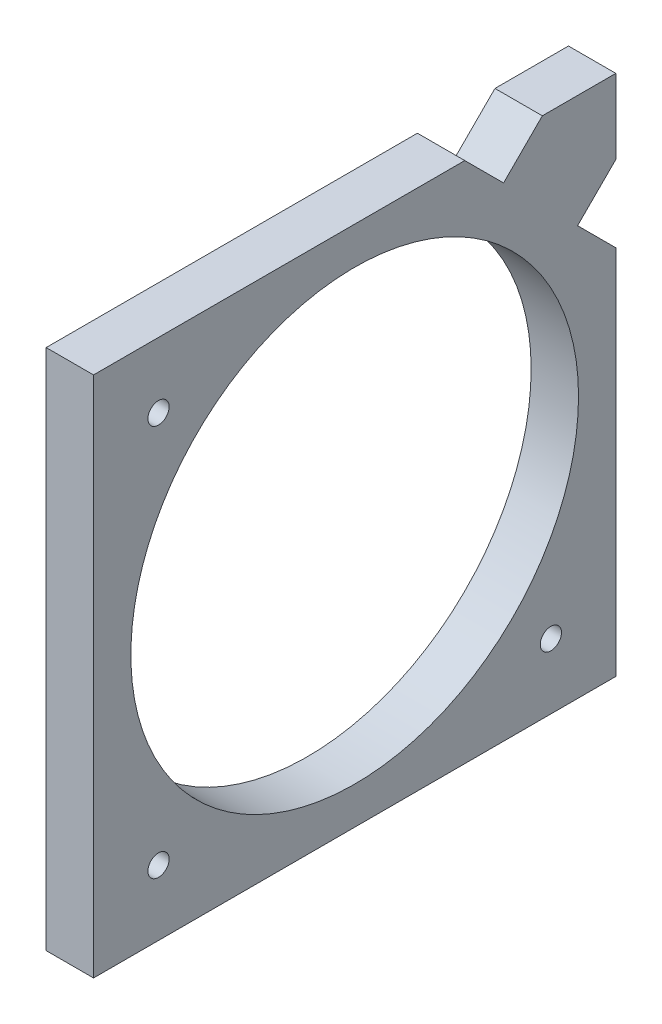
ISO-10303-21;
HEADER;
FILE_DESCRIPTION(('STEP AP214'),'2;1');
FILE_NAME('part.step','',(''),(''),'','','');
FILE_SCHEMA(('AUTOMOTIVE_DESIGN { 1 0 10303 214 1 1 1 1 }'));
ENDSEC;
DATA;
#1=APPLICATION_CONTEXT('core data for automotive mechanical design processes');
#2=APPLICATION_PROTOCOL_DEFINITION('international standard','automotive_design',2000,#1);
#3=PRODUCT_CONTEXT('',#1,'mechanical');
#4=PRODUCT('Part','Part','',(#3));
#5=PRODUCT_RELATED_PRODUCT_CATEGORY('part','',(#4));
#6=PRODUCT_DEFINITION_FORMATION('','',#4);
#7=PRODUCT_DEFINITION_CONTEXT('part definition',#1,'design');
#8=PRODUCT_DEFINITION('design','',#6,#7);
#9=PRODUCT_DEFINITION_SHAPE('','',#8);
#10=(LENGTH_UNIT() NAMED_UNIT(*) SI_UNIT(.MILLI.,.METRE.));
#11=(NAMED_UNIT(*) PLANE_ANGLE_UNIT() SI_UNIT($,.RADIAN.));
#12=(NAMED_UNIT(*) SI_UNIT($,.STERADIAN.) SOLID_ANGLE_UNIT());
#13=UNCERTAINTY_MEASURE_WITH_UNIT(LENGTH_MEASURE(1.E-05),#10,'distance_accuracy_value','');
#14=(GEOMETRIC_REPRESENTATION_CONTEXT(3) GLOBAL_UNCERTAINTY_ASSIGNED_CONTEXT((#13)) GLOBAL_UNIT_ASSIGNED_CONTEXT((#10,
#11,#12)) REPRESENTATION_CONTEXT('',''));
#15=CARTESIAN_POINT('',(0.,0.,0.));
#16=DIRECTION('',(0.,0.,1.));
#17=DIRECTION('',(1.,0.,0.));
#18=AXIS2_PLACEMENT_3D('',#15,#16,#17);
#19=CARTESIAN_POINT('',(6.35,0.,0.));
#20=DIRECTION('',(-1.,0.,0.));
#21=DIRECTION('',(0.,0.,1.));
#22=AXIS2_PLACEMENT_3D('',#19,#20,#21);
#23=PLANE('',#22);
#24=CARTESIAN_POINT('',(6.35,8.75,-61.2925582476535));
#25=DIRECTION('',(1.,0.,0.));
#26=DIRECTION('',(0.,0.,-1.));
#27=AXIS2_PLACEMENT_3D('',#24,#25,#26);
#28=CIRCLE('',#27,1.42240000000001);
#29=CARTESIAN_POINT('',(6.35,8.75,-62.7149582476535));
#30=VERTEX_POINT('',#29);
#31=EDGE_CURVE('E228',#30,#30,#28,.T.);
#32=ORIENTED_EDGE('',*,*,#31,.F.);
#33=EDGE_LOOP('',(#32));
#34=FACE_BOUND('',#33,.T.);
#35=CARTESIAN_POINT('',(6.35,8.75,-8.70744175234652));
#36=DIRECTION('',(1.,0.,0.));
#37=DIRECTION('',(0.,0.,1.));
#38=AXIS2_PLACEMENT_3D('',#35,#36,#37);
#39=CIRCLE('',#38,1.4224);
#40=CARTESIAN_POINT('',(6.35,8.75,-7.28504175234652));
#41=VERTEX_POINT('',#40);
#42=EDGE_CURVE('E222',#41,#41,#39,.T.);
#43=ORIENTED_EDGE('',*,*,#42,.F.);
#44=EDGE_LOOP('',(#43));
#45=FACE_BOUND('',#44,.T.);
#46=CARTESIAN_POINT('',(6.35,61.25,-8.70744175234652));
#47=DIRECTION('',(1.,0.,0.));
#48=DIRECTION('',(0.,0.,-1.));
#49=AXIS2_PLACEMENT_3D('',#46,#47,#48);
#50=CIRCLE('',#49,1.4224);
#51=CARTESIAN_POINT('',(6.35,61.25,-10.1298417523465));
#52=VERTEX_POINT('',#51);
#53=EDGE_CURVE('E216',#52,#52,#50,.T.);
#54=ORIENTED_EDGE('',*,*,#53,.F.);
#55=EDGE_LOOP('',(#54));
#56=FACE_BOUND('',#55,.T.);
#57=DIRECTION('',(0.,-1.,0.));
#58=VECTOR('',#57,1.);
#59=CARTESIAN_POINT('',(6.35,0.,0.));
#60=LINE('',#59,#58);
#61=CARTESIAN_POINT('',(6.35,70.,0.));
#62=VERTEX_POINT('',#61);
#63=CARTESIAN_POINT('',(6.35,0.,0.));
#64=VERTEX_POINT('',#63);
#65=EDGE_CURVE('E162',#62,#64,#60,.T.);
#66=ORIENTED_EDGE('',*,*,#65,.T.);
#67=DIRECTION('',(0.,0.,-1.));
#68=VECTOR('',#67,1.);
#69=CARTESIAN_POINT('',(6.35,0.,0.));
#70=LINE('',#69,#68);
#71=CARTESIAN_POINT('',(6.35,0.,-70.));
#72=VERTEX_POINT('',#71);
#73=EDGE_CURVE('E100',#64,#72,#70,.T.);
#74=ORIENTED_EDGE('',*,*,#73,.T.);
#75=DIRECTION('',(0.,1.,0.));
#76=VECTOR('',#75,1.);
#77=CARTESIAN_POINT('',(6.35,49.7566150142179,-70.));
#78=LINE('',#77,#76);
#79=CARTESIAN_POINT('',(6.35,49.7566150142179,-70.));
#80=VERTEX_POINT('',#79);
#81=EDGE_CURVE('E183',#72,#80,#78,.T.);
#82=ORIENTED_EDGE('',*,*,#81,.T.);
#83=DIRECTION('',(0.,0.707106781186539,0.707106781186556));
#84=VECTOR('',#83,1.);
#85=CARTESIAN_POINT('',(6.35,54.8841313668253,-64.8724836473926));
#86=LINE('',#85,#84);
#87=CARTESIAN_POINT('',(6.35,54.8841313668253,-64.8724836473926));
#88=VERTEX_POINT('',#87);
#89=EDGE_CURVE('E202',#80,#88,#86,.T.);
#90=ORIENTED_EDGE('',*,*,#89,.T.);
#91=DIRECTION('',(0.,0.707106781186557,-0.707106781186538));
#92=VECTOR('',#91,1.);
#93=CARTESIAN_POINT('',(6.35,60.0116477194329,-70.));
#94=LINE('',#93,#92);
#95=CARTESIAN_POINT('',(6.35,60.0116477194329,-70.));
#96=VERTEX_POINT('',#95);
#97=EDGE_CURVE('E199',#88,#96,#94,.T.);
#98=ORIENTED_EDGE('',*,*,#97,.T.);
#99=DIRECTION('',(0.,1.,0.));
#100=VECTOR('',#99,1.);
#101=CARTESIAN_POINT('',(6.35,70.,-70.));
#102=LINE('',#101,#100);
#103=CARTESIAN_POINT('',(6.35,70.,-70.));
#104=VERTEX_POINT('',#103);
#105=EDGE_CURVE('E201',#96,#104,#102,.T.);
#106=ORIENTED_EDGE('',*,*,#105,.T.);
#107=DIRECTION('',(0.,0.,1.));
#108=VECTOR('',#107,1.);
#109=CARTESIAN_POINT('',(6.35,70.,-60.1486352668631));
#110=LINE('',#109,#108);
#111=CARTESIAN_POINT('',(6.35,70.,-60.1486352668631));
#112=VERTEX_POINT('',#111);
#113=EDGE_CURVE('E125',#104,#112,#110,.T.);
#114=ORIENTED_EDGE('',*,*,#113,.T.);
#115=DIRECTION('',(0.,-0.707106781186557,0.707106781186538));
#116=VECTOR('',#115,1.);
#117=CARTESIAN_POINT('',(6.35,64.8039898736772,-54.9526251405404));
#118=LINE('',#117,#116);
#119=CARTESIAN_POINT('',(6.35,64.8039898736772,-54.9526251405404));
#120=VERTEX_POINT('',#119);
#121=EDGE_CURVE('E119',#112,#120,#118,.T.);
#122=ORIENTED_EDGE('',*,*,#121,.T.);
#123=DIRECTION('',(0.,0.707106781186539,0.707106781186556));
#124=VECTOR('',#123,1.);
#125=CARTESIAN_POINT('',(6.35,64.8039898736772,-54.9526251405404));
#126=LINE('',#125,#124);
#127=CARTESIAN_POINT('',(6.35,70.,-49.7566150142174));
#128=VERTEX_POINT('',#127);
#129=EDGE_CURVE('E123',#120,#128,#126,.T.);
#130=ORIENTED_EDGE('',*,*,#129,.T.);
#131=DIRECTION('',(0.,0.,1.));
#132=VECTOR('',#131,1.);
#133=CARTESIAN_POINT('',(6.35,70.,0.));
#134=LINE('',#133,#132);
#135=EDGE_CURVE('E51',#128,#62,#134,.T.);
#136=ORIENTED_EDGE('',*,*,#135,.T.);
#137=EDGE_LOOP('',(#66,#74,#82,#90,#98,#106,#114,#122,#130,#136));
#138=FACE_BOUND('',#137,.T.);
#139=CARTESIAN_POINT('',(6.35,35.,-35.));
#140=DIRECTION('',(1.,0.,0.));
#141=DIRECTION('',(0.,0.,-1.));
#142=AXIS2_PLACEMENT_3D('',#139,#140,#141);
#143=CIRCLE('',#142,30.);
#144=CARTESIAN_POINT('',(6.35,35.,-65.));
#145=VERTEX_POINT('',#144);
#146=EDGE_CURVE('E147',#145,#145,#143,.T.);
#147=ORIENTED_EDGE('',*,*,#146,.F.);
#148=EDGE_LOOP('',(#147));
#149=FACE_BOUND('',#148,.T.);
#150=ADVANCED_FACE('F34',(#34,#45,#56,#138,#149),#23,.F.);
#151=CARTESIAN_POINT('',(0.,0.,0.));
#152=DIRECTION('',(-1.,0.,0.));
#153=DIRECTION('',(0.,0.,1.));
#154=AXIS2_PLACEMENT_3D('',#151,#152,#153);
#155=PLANE('',#154);
#156=CARTESIAN_POINT('',(0.,8.75,-61.2925582476535));
#157=DIRECTION('',(1.,0.,0.));
#158=DIRECTION('',(0.,0.,-1.));
#159=AXIS2_PLACEMENT_3D('',#156,#157,#158);
#160=CIRCLE('',#159,1.42240000000001);
#161=CARTESIAN_POINT('',(0.,8.75,-62.7149582476535));
#162=VERTEX_POINT('',#161);
#163=EDGE_CURVE('E225',#162,#162,#160,.T.);
#164=ORIENTED_EDGE('',*,*,#163,.T.);
#165=EDGE_LOOP('',(#164));
#166=FACE_BOUND('',#165,.T.);
#167=CARTESIAN_POINT('',(0.,8.75,-8.70744175234652));
#168=DIRECTION('',(1.,0.,0.));
#169=DIRECTION('',(0.,0.,1.));
#170=AXIS2_PLACEMENT_3D('',#167,#168,#169);
#171=CIRCLE('',#170,1.4224);
#172=CARTESIAN_POINT('',(0.,8.75,-7.28504175234652));
#173=VERTEX_POINT('',#172);
#174=EDGE_CURVE('E219',#173,#173,#171,.T.);
#175=ORIENTED_EDGE('',*,*,#174,.T.);
#176=EDGE_LOOP('',(#175));
#177=FACE_BOUND('',#176,.T.);
#178=CARTESIAN_POINT('',(0.,61.25,-8.70744175234652));
#179=DIRECTION('',(1.,0.,0.));
#180=DIRECTION('',(0.,0.,-1.));
#181=AXIS2_PLACEMENT_3D('',#178,#179,#180);
#182=CIRCLE('',#181,1.4224);
#183=CARTESIAN_POINT('',(0.,61.25,-10.1298417523465));
#184=VERTEX_POINT('',#183);
#185=EDGE_CURVE('E213',#184,#184,#182,.T.);
#186=ORIENTED_EDGE('',*,*,#185,.T.);
#187=EDGE_LOOP('',(#186));
#188=FACE_BOUND('',#187,.T.);
#189=DIRECTION('',(0.,-1.,0.));
#190=VECTOR('',#189,1.);
#191=CARTESIAN_POINT('',(0.,0.,0.));
#192=LINE('',#191,#190);
#193=CARTESIAN_POINT('',(0.,70.,0.));
#194=VERTEX_POINT('',#193);
#195=CARTESIAN_POINT('',(0.,0.,0.));
#196=VERTEX_POINT('',#195);
#197=EDGE_CURVE('E143',#194,#196,#192,.T.);
#198=ORIENTED_EDGE('',*,*,#197,.F.);
#199=DIRECTION('',(0.,0.,1.));
#200=VECTOR('',#199,1.);
#201=CARTESIAN_POINT('',(0.,70.,0.));
#202=LINE('',#201,#200);
#203=CARTESIAN_POINT('',(0.,70.,-49.7566150142174));
#204=VERTEX_POINT('',#203);
#205=EDGE_CURVE('E92',#204,#194,#202,.T.);
#206=ORIENTED_EDGE('',*,*,#205,.F.);
#207=DIRECTION('',(0.,0.707106781186539,0.707106781186556));
#208=VECTOR('',#207,1.);
#209=CARTESIAN_POINT('',(0.,64.8039898736772,-54.9526251405404));
#210=LINE('',#209,#208);
#211=CARTESIAN_POINT('',(0.,64.8039898736772,-54.9526251405404));
#212=VERTEX_POINT('',#211);
#213=EDGE_CURVE('E86',#212,#204,#210,.T.);
#214=ORIENTED_EDGE('',*,*,#213,.F.);
#215=DIRECTION('',(0.,-0.707106781186557,0.707106781186538));
#216=VECTOR('',#215,1.);
#217=CARTESIAN_POINT('',(0.,64.8039898736772,-54.9526251405404));
#218=LINE('',#217,#216);
#219=CARTESIAN_POINT('',(0.,70.,-60.1486352668631));
#220=VERTEX_POINT('',#219);
#221=EDGE_CURVE('E133',#220,#212,#218,.T.);
#222=ORIENTED_EDGE('',*,*,#221,.F.);
#223=DIRECTION('',(0.,0.,1.));
#224=VECTOR('',#223,1.);
#225=CARTESIAN_POINT('',(0.,70.,-60.1486352668631));
#226=LINE('',#225,#224);
#227=CARTESIAN_POINT('',(0.,70.,-70.));
#228=VERTEX_POINT('',#227);
#229=EDGE_CURVE('E157',#228,#220,#226,.T.);
#230=ORIENTED_EDGE('',*,*,#229,.F.);
#231=DIRECTION('',(0.,1.,0.));
#232=VECTOR('',#231,1.);
#233=CARTESIAN_POINT('',(0.,70.,-70.));
#234=LINE('',#233,#232);
#235=CARTESIAN_POINT('',(0.,60.0116477194329,-70.));
#236=VERTEX_POINT('',#235);
#237=EDGE_CURVE('E155',#236,#228,#234,.T.);
#238=ORIENTED_EDGE('',*,*,#237,.F.);
#239=DIRECTION('',(0.,0.707106781186557,-0.707106781186538));
#240=VECTOR('',#239,1.);
#241=CARTESIAN_POINT('',(0.,60.0116477194329,-70.));
#242=LINE('',#241,#240);
#243=CARTESIAN_POINT('',(0.,54.8841313668253,-64.8724836473926));
#244=VERTEX_POINT('',#243);
#245=EDGE_CURVE('E153',#244,#236,#242,.T.);
#246=ORIENTED_EDGE('',*,*,#245,.F.);
#247=DIRECTION('',(0.,0.707106781186539,0.707106781186556));
#248=VECTOR('',#247,1.);
#249=CARTESIAN_POINT('',(0.,54.8841313668253,-64.8724836473926));
#250=LINE('',#249,#248);
#251=CARTESIAN_POINT('',(0.,49.7566150142179,-70.));
#252=VERTEX_POINT('',#251);
#253=EDGE_CURVE('E151',#252,#244,#250,.T.);
#254=ORIENTED_EDGE('',*,*,#253,.F.);
#255=DIRECTION('',(0.,1.,0.));
#256=VECTOR('',#255,1.);
#257=CARTESIAN_POINT('',(0.,49.7566150142179,-70.));
#258=LINE('',#257,#256);
#259=CARTESIAN_POINT('',(0.,0.,-70.));
#260=VERTEX_POINT('',#259);
#261=EDGE_CURVE('E149',#260,#252,#258,.T.);
#262=ORIENTED_EDGE('',*,*,#261,.F.);
#263=DIRECTION('',(0.,0.,-1.));
#264=VECTOR('',#263,1.);
#265=CARTESIAN_POINT('',(0.,0.,0.));
#266=LINE('',#265,#264);
#267=EDGE_CURVE('E146',#196,#260,#266,.T.);
#268=ORIENTED_EDGE('',*,*,#267,.F.);
#269=EDGE_LOOP('',(#198,#206,#214,#222,#230,#238,#246,#254,#262,#268));
#270=FACE_BOUND('',#269,.T.);
#271=CARTESIAN_POINT('',(0.,35.,-35.));
#272=DIRECTION('',(1.,0.,0.));
#273=DIRECTION('',(0.,0.,-1.));
#274=AXIS2_PLACEMENT_3D('',#271,#272,#273);
#275=CIRCLE('',#274,30.);
#276=CARTESIAN_POINT('',(0.,35.,-65.));
#277=VERTEX_POINT('',#276);
#278=EDGE_CURVE('E210',#277,#277,#275,.T.);
#279=ORIENTED_EDGE('',*,*,#278,.T.);
#280=EDGE_LOOP('',(#279));
#281=FACE_BOUND('',#280,.T.);
#282=ADVANCED_FACE('F187',(#166,#177,#188,#270,#281),#155,.T.);
#283=CARTESIAN_POINT('',(6.35,0.,0.));
#284=DIRECTION('',(0.,0.,-1.));
#285=DIRECTION('',(0.,1.,0.));
#286=AXIS2_PLACEMENT_3D('',#283,#284,#285);
#287=PLANE('',#286);
#288=ORIENTED_EDGE('',*,*,#197,.T.);
#289=DIRECTION('',(-1.,0.,0.));
#290=VECTOR('',#289,1.);
#291=CARTESIAN_POINT('',(6.35,0.,0.));
#292=LINE('',#291,#290);
#293=EDGE_CURVE('E11',#64,#196,#292,.T.);
#294=ORIENTED_EDGE('',*,*,#293,.F.);
#295=ORIENTED_EDGE('',*,*,#65,.F.);
#296=DIRECTION('',(-1.,0.,0.));
#297=VECTOR('',#296,1.);
#298=CARTESIAN_POINT('',(6.35,70.,0.));
#299=LINE('',#298,#297);
#300=EDGE_CURVE('E139',#62,#194,#299,.T.);
#301=ORIENTED_EDGE('',*,*,#300,.T.);
#302=EDGE_LOOP('',(#288,#294,#295,#301));
#303=FACE_BOUND('',#302,.T.);
#304=ADVANCED_FACE('F36',(#303),#287,.F.);
#305=CARTESIAN_POINT('',(6.35,0.,0.));
#306=DIRECTION('',(0.,1.,0.));
#307=DIRECTION('',(0.,0.,1.));
#308=AXIS2_PLACEMENT_3D('',#305,#306,#307);
#309=PLANE('',#308);
#310=ORIENTED_EDGE('',*,*,#267,.T.);
#311=DIRECTION('',(-1.,0.,0.));
#312=VECTOR('',#311,1.);
#313=CARTESIAN_POINT('',(6.35,0.,-70.));
#314=LINE('',#313,#312);
#315=EDGE_CURVE('E43',#72,#260,#314,.T.);
#316=ORIENTED_EDGE('',*,*,#315,.F.);
#317=ORIENTED_EDGE('',*,*,#73,.F.);
#318=ORIENTED_EDGE('',*,*,#293,.T.);
#319=EDGE_LOOP('',(#310,#316,#317,#318));
#320=FACE_BOUND('',#319,.T.);
#321=ADVANCED_FACE('F287',(#320),#309,.F.);
#322=CARTESIAN_POINT('',(6.35,49.7566150142179,-70.));
#323=DIRECTION('',(0.,0.,1.));
#324=DIRECTION('',(1.,0.,0.));
#325=AXIS2_PLACEMENT_3D('',#322,#323,#324);
#326=PLANE('',#325);
#327=ORIENTED_EDGE('',*,*,#261,.T.);
#328=DIRECTION('',(-1.,0.,0.));
#329=VECTOR('',#328,1.);
#330=CARTESIAN_POINT('',(6.35,49.7566150142179,-70.));
#331=LINE('',#330,#329);
#332=EDGE_CURVE('E175',#80,#252,#331,.T.);
#333=ORIENTED_EDGE('',*,*,#332,.F.);
#334=ORIENTED_EDGE('',*,*,#81,.F.);
#335=ORIENTED_EDGE('',*,*,#315,.T.);
#336=EDGE_LOOP('',(#327,#333,#334,#335));
#337=FACE_BOUND('',#336,.T.);
#338=ADVANCED_FACE('F181',(#337),#326,.F.);
#339=CARTESIAN_POINT('',(6.35,54.8841313668253,-64.8724836473926));
#340=DIRECTION('',(0.,-0.707106781186556,0.707106781186539));
#341=DIRECTION('',(0.,-0.707106781186539,-0.707106781186556));
#342=AXIS2_PLACEMENT_3D('',#339,#340,#341);
#343=PLANE('',#342);
#344=ORIENTED_EDGE('',*,*,#253,.T.);
#345=DIRECTION('',(-1.,0.,0.));
#346=VECTOR('',#345,1.);
#347=CARTESIAN_POINT('',(6.35,54.8841313668253,-64.8724836473926));
#348=LINE('',#347,#346);
#349=EDGE_CURVE('E172',#88,#244,#348,.T.);
#350=ORIENTED_EDGE('',*,*,#349,.F.);
#351=ORIENTED_EDGE('',*,*,#89,.F.);
#352=ORIENTED_EDGE('',*,*,#332,.T.);
#353=EDGE_LOOP('',(#344,#350,#351,#352));
#354=FACE_BOUND('',#353,.T.);
#355=ADVANCED_FACE('F193',(#354),#343,.F.);
#356=CARTESIAN_POINT('',(6.35,60.0116477194329,-70.));
#357=DIRECTION('',(0.,0.707106781186538,0.707106781186557));
#358=DIRECTION('',(0.,-0.707106781186557,0.707106781186538));
#359=AXIS2_PLACEMENT_3D('',#356,#357,#358);
#360=PLANE('',#359);
#361=ORIENTED_EDGE('',*,*,#245,.T.);
#362=DIRECTION('',(-1.,0.,0.));
#363=VECTOR('',#362,1.);
#364=CARTESIAN_POINT('',(6.35,60.0116477194329,-70.));
#365=LINE('',#364,#363);
#366=EDGE_CURVE('E169',#96,#236,#365,.T.);
#367=ORIENTED_EDGE('',*,*,#366,.F.);
#368=ORIENTED_EDGE('',*,*,#97,.F.);
#369=ORIENTED_EDGE('',*,*,#349,.T.);
#370=EDGE_LOOP('',(#361,#367,#368,#369));
#371=FACE_BOUND('',#370,.T.);
#372=ADVANCED_FACE('F197',(#371),#360,.F.);
#373=CARTESIAN_POINT('',(6.35,70.,-70.));
#374=DIRECTION('',(0.,0.,1.));
#375=DIRECTION('',(1.,0.,0.));
#376=AXIS2_PLACEMENT_3D('',#373,#374,#375);
#377=PLANE('',#376);
#378=ORIENTED_EDGE('',*,*,#237,.T.);
#379=DIRECTION('',(-1.,0.,0.));
#380=VECTOR('',#379,1.);
#381=CARTESIAN_POINT('',(6.35,70.,-70.));
#382=LINE('',#381,#380);
#383=EDGE_CURVE('E166',#104,#228,#382,.T.);
#384=ORIENTED_EDGE('',*,*,#383,.F.);
#385=ORIENTED_EDGE('',*,*,#105,.F.);
#386=ORIENTED_EDGE('',*,*,#366,.T.);
#387=EDGE_LOOP('',(#378,#384,#385,#386));
#388=FACE_BOUND('',#387,.T.);
#389=ADVANCED_FACE('F277',(#388),#377,.F.);
#390=CARTESIAN_POINT('',(6.35,70.,-60.1486352668631));
#391=DIRECTION('',(0.,-1.,0.));
#392=DIRECTION('',(0.,0.,-1.));
#393=AXIS2_PLACEMENT_3D('',#390,#391,#392);
#394=PLANE('',#393);
#395=ORIENTED_EDGE('',*,*,#229,.T.);
#396=DIRECTION('',(-1.,0.,0.));
#397=VECTOR('',#396,1.);
#398=CARTESIAN_POINT('',(6.35,70.,-60.1486352668631));
#399=LINE('',#398,#397);
#400=EDGE_CURVE('E134',#112,#220,#399,.T.);
#401=ORIENTED_EDGE('',*,*,#400,.F.);
#402=ORIENTED_EDGE('',*,*,#113,.F.);
#403=ORIENTED_EDGE('',*,*,#383,.T.);
#404=EDGE_LOOP('',(#395,#401,#402,#403));
#405=FACE_BOUND('',#404,.T.);
#406=ADVANCED_FACE('F274',(#405),#394,.F.);
#407=CARTESIAN_POINT('',(6.35,64.8039898736772,-54.9526251405404));
#408=DIRECTION('',(0.,-0.707106781186538,-0.707106781186557));
#409=DIRECTION('',(0.,0.707106781186557,-0.707106781186538));
#410=AXIS2_PLACEMENT_3D('',#407,#408,#409);
#411=PLANE('',#410);
#412=ORIENTED_EDGE('',*,*,#221,.T.);
#413=DIRECTION('',(-1.,0.,0.));
#414=VECTOR('',#413,1.);
#415=CARTESIAN_POINT('',(6.35,64.8039898736772,-54.9526251405404));
#416=LINE('',#415,#414);
#417=EDGE_CURVE('E130',#120,#212,#416,.T.);
#418=ORIENTED_EDGE('',*,*,#417,.F.);
#419=ORIENTED_EDGE('',*,*,#121,.F.);
#420=ORIENTED_EDGE('',*,*,#400,.T.);
#421=EDGE_LOOP('',(#412,#418,#419,#420));
#422=FACE_BOUND('',#421,.T.);
#423=ADVANCED_FACE('F131',(#422),#411,.F.);
#424=CARTESIAN_POINT('',(6.35,64.8039898736772,-54.9526251405404));
#425=DIRECTION('',(0.,-0.707106781186556,0.707106781186539));
#426=DIRECTION('',(0.,-0.707106781186539,-0.707106781186556));
#427=AXIS2_PLACEMENT_3D('',#424,#425,#426);
#428=PLANE('',#427);
#429=ORIENTED_EDGE('',*,*,#213,.T.);
#430=DIRECTION('',(-1.,0.,0.));
#431=VECTOR('',#430,1.);
#432=CARTESIAN_POINT('',(6.35,70.,-49.7566150142174));
#433=LINE('',#432,#431);
#434=EDGE_CURVE('E135',#128,#204,#433,.T.);
#435=ORIENTED_EDGE('',*,*,#434,.F.);
#436=ORIENTED_EDGE('',*,*,#129,.F.);
#437=ORIENTED_EDGE('',*,*,#417,.T.);
#438=EDGE_LOOP('',(#429,#435,#436,#437));
#439=FACE_BOUND('',#438,.T.);
#440=ADVANCED_FACE('F137',(#439),#428,.F.);
#441=CARTESIAN_POINT('',(6.35,70.,0.));
#442=DIRECTION('',(0.,-1.,0.));
#443=DIRECTION('',(0.,0.,-1.));
#444=AXIS2_PLACEMENT_3D('',#441,#442,#443);
#445=PLANE('',#444);
#446=ORIENTED_EDGE('',*,*,#205,.T.);
#447=ORIENTED_EDGE('',*,*,#300,.F.);
#448=ORIENTED_EDGE('',*,*,#135,.F.);
#449=ORIENTED_EDGE('',*,*,#434,.T.);
#450=EDGE_LOOP('',(#446,#447,#448,#449));
#451=FACE_BOUND('',#450,.T.);
#452=ADVANCED_FACE('F261',(#451),#445,.F.);
#453=CARTESIAN_POINT('',(6.35,35.,-35.));
#454=DIRECTION('',(-1.,0.,0.));
#455=DIRECTION('',(0.,0.,1.));
#456=AXIS2_PLACEMENT_3D('',#453,#454,#455);
#457=CYLINDRICAL_SURFACE('',#456,30.);
#458=ORIENTED_EDGE('',*,*,#146,.T.);
#459=EDGE_LOOP('',(#458));
#460=FACE_BOUND('',#459,.T.);
#461=ORIENTED_EDGE('',*,*,#278,.F.);
#462=EDGE_LOOP('',(#461));
#463=FACE_BOUND('',#462,.T.);
#464=ADVANCED_FACE('F252',(#460,#463),#457,.F.);
#465=CARTESIAN_POINT('',(0.,61.25,-8.70744175234652));
#466=DIRECTION('',(1.,0.,0.));
#467=DIRECTION('',(0.,0.,-1.));
#468=AXIS2_PLACEMENT_3D('',#465,#466,#467);
#469=CYLINDRICAL_SURFACE('',#468,1.4224);
#470=ORIENTED_EDGE('',*,*,#185,.F.);
#471=EDGE_LOOP('',(#470));
#472=FACE_BOUND('',#471,.T.);
#473=ORIENTED_EDGE('',*,*,#53,.T.);
#474=EDGE_LOOP('',(#473));
#475=FACE_BOUND('',#474,.T.);
#476=ADVANCED_FACE('F250',(#472,#475),#469,.F.);
#477=CARTESIAN_POINT('',(0.,8.75,-8.70744175234652));
#478=DIRECTION('',(1.,0.,0.));
#479=DIRECTION('',(0.,0.,-1.));
#480=AXIS2_PLACEMENT_3D('',#477,#478,#479);
#481=CYLINDRICAL_SURFACE('',#480,1.4224);
#482=ORIENTED_EDGE('',*,*,#174,.F.);
#483=EDGE_LOOP('',(#482));
#484=FACE_BOUND('',#483,.T.);
#485=ORIENTED_EDGE('',*,*,#42,.T.);
#486=EDGE_LOOP('',(#485));
#487=FACE_BOUND('',#486,.T.);
#488=ADVANCED_FACE('F239',(#484,#487),#481,.F.);
#489=CARTESIAN_POINT('',(0.,8.75,-61.2925582476535));
#490=DIRECTION('',(1.,0.,0.));
#491=DIRECTION('',(0.,0.,-1.));
#492=AXIS2_PLACEMENT_3D('',#489,#490,#491);
#493=CYLINDRICAL_SURFACE('',#492,1.42240000000001);
#494=ORIENTED_EDGE('',*,*,#163,.F.);
#495=EDGE_LOOP('',(#494));
#496=FACE_BOUND('',#495,.T.);
#497=ORIENTED_EDGE('',*,*,#31,.T.);
#498=EDGE_LOOP('',(#497));
#499=FACE_BOUND('',#498,.T.);
#500=ADVANCED_FACE('F236',(#496,#499),#493,.F.);
#501=CLOSED_SHELL('',(#150,#282,#304,#321,#338,#355,#372,#389,#406,#423,#440,#452,#464,#476,
#488,#500));
#502=MANIFOLD_SOLID_BREP('B2',#501);
#503=ADVANCED_BREP_SHAPE_REPRESENTATION('',(#18,#502),#14);
#504=SHAPE_DEFINITION_REPRESENTATION(#9,#503);
ENDSEC;
END-ISO-10303-21;
